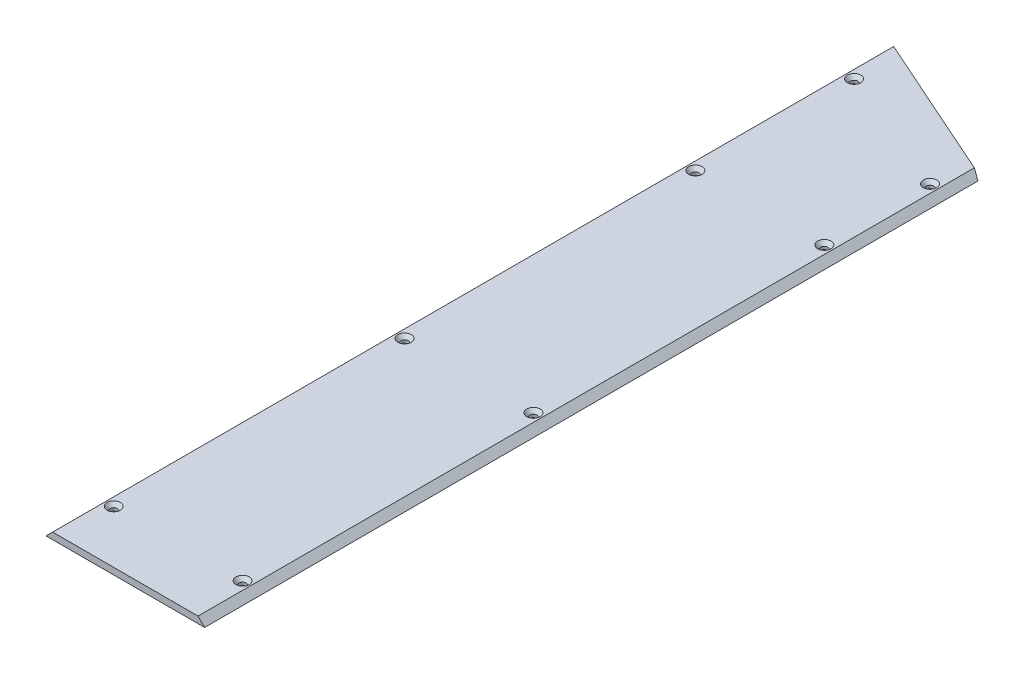
ISO-10303-21;
HEADER;
FILE_DESCRIPTION(('STEP AP214'),'2;1');
FILE_NAME('part.step','',(''),(''),'','','');
FILE_SCHEMA(('AUTOMOTIVE_DESIGN { 1 0 10303 214 1 1 1 1 }'));
ENDSEC;
DATA;
#1=APPLICATION_CONTEXT('core data for automotive mechanical design processes');
#2=APPLICATION_PROTOCOL_DEFINITION('international standard','automotive_design',2000,#1);
#3=PRODUCT_CONTEXT('',#1,'mechanical');
#4=PRODUCT('Part','Part','',(#3));
#5=PRODUCT_RELATED_PRODUCT_CATEGORY('part','',(#4));
#6=PRODUCT_DEFINITION_FORMATION('','',#4);
#7=PRODUCT_DEFINITION_CONTEXT('part definition',#1,'design');
#8=PRODUCT_DEFINITION('design','',#6,#7);
#9=PRODUCT_DEFINITION_SHAPE('','',#8);
#10=(LENGTH_UNIT() NAMED_UNIT(*) SI_UNIT(.MILLI.,.METRE.));
#11=(NAMED_UNIT(*) PLANE_ANGLE_UNIT() SI_UNIT($,.RADIAN.));
#12=(NAMED_UNIT(*) SI_UNIT($,.STERADIAN.) SOLID_ANGLE_UNIT());
#13=UNCERTAINTY_MEASURE_WITH_UNIT(LENGTH_MEASURE(1.E-05),#10,'distance_accuracy_value','');
#14=(GEOMETRIC_REPRESENTATION_CONTEXT(3) GLOBAL_UNCERTAINTY_ASSIGNED_CONTEXT((#13)) GLOBAL_UNIT_ASSIGNED_CONTEXT((#10,
#11,#12)) REPRESENTATION_CONTEXT('',''));
#15=CARTESIAN_POINT('',(0.,0.,0.));
#16=DIRECTION('',(0.,0.,1.));
#17=DIRECTION('',(1.,0.,0.));
#18=AXIS2_PLACEMENT_3D('',#15,#16,#17);
#19=CARTESIAN_POINT('',(0.,6.35,0.));
#20=DIRECTION('',(0.,0.,-1.));
#21=DIRECTION('',(-1.,0.,0.));
#22=AXIS2_PLACEMENT_3D('',#19,#20,#21);
#23=PLANE('',#22);
#24=DIRECTION('',(1.,0.,0.));
#25=VECTOR('',#24,1.);
#26=CARTESIAN_POINT('',(0.,0.,0.));
#27=LINE('',#26,#25);
#28=CARTESIAN_POINT('',(0.,0.,0.));
#29=VERTEX_POINT('',#28);
#30=CARTESIAN_POINT('',(152.4,0.,0.));
#31=VERTEX_POINT('',#30);
#32=EDGE_CURVE('E91',#29,#31,#27,.T.);
#33=ORIENTED_EDGE('',*,*,#32,.T.);
#34=DIRECTION('',(0.707106781186548,-0.707106781186548,0.));
#35=VECTOR('',#34,1.);
#36=CARTESIAN_POINT('',(146.05,6.35,0.));
#37=LINE('',#36,#35);
#38=CARTESIAN_POINT('',(146.05,6.35,0.));
#39=VERTEX_POINT('',#38);
#40=EDGE_CURVE('E40',#31,#39,#37,.F.);
#41=ORIENTED_EDGE('',*,*,#40,.T.);
#42=DIRECTION('',(1.,0.,0.));
#43=VECTOR('',#42,1.);
#44=CARTESIAN_POINT('',(0.,6.35,0.));
#45=LINE('',#44,#43);
#46=CARTESIAN_POINT('',(6.34999999999985,6.35,0.));
#47=VERTEX_POINT('',#46);
#48=EDGE_CURVE('E90',#47,#39,#45,.T.);
#49=ORIENTED_EDGE('',*,*,#48,.F.);
#50=DIRECTION('',(0.707106781186541,0.707106781186554,0.));
#51=VECTOR('',#50,1.);
#52=CARTESIAN_POINT('',(6.34999999999986,6.35,0.));
#53=LINE('',#52,#51);
#54=EDGE_CURVE('E101',#47,#29,#53,.F.);
#55=ORIENTED_EDGE('',*,*,#54,.T.);
#56=EDGE_LOOP('',(#33,#41,#49,#55));
#57=FACE_BOUND('',#56,.T.);
#58=ADVANCED_FACE('F32',(#57),#23,.F.);
#59=CARTESIAN_POINT('',(0.,6.35,0.));
#60=DIRECTION('',(0.,-1.,0.));
#61=DIRECTION('',(0.,0.,-1.));
#62=AXIS2_PLACEMENT_3D('',#59,#60,#61);
#63=PLANE('',#62);
#64=CARTESIAN_POINT('',(14.2875,6.35,-762.));
#65=DIRECTION('',(0.,1.,0.));
#66=DIRECTION('',(0.,0.,1.));
#67=AXIS2_PLACEMENT_3D('',#64,#65,#66);
#68=CIRCLE('',#67,6.4389);
#69=CARTESIAN_POINT('',(14.2875,6.35,-755.5611));
#70=VERTEX_POINT('',#69);
#71=EDGE_CURVE('E176',#70,#70,#68,.T.);
#72=ORIENTED_EDGE('',*,*,#71,.F.);
#73=EDGE_LOOP('',(#72));
#74=FACE_BOUND('',#73,.T.);
#75=CARTESIAN_POINT('',(138.1125,6.35,-711.2));
#76=DIRECTION('',(0.,1.,0.));
#77=DIRECTION('',(0.,0.,1.));
#78=AXIS2_PLACEMENT_3D('',#75,#76,#77);
#79=CIRCLE('',#78,6.4389);
#80=CARTESIAN_POINT('',(138.1125,6.35,-704.7611));
#81=VERTEX_POINT('',#80);
#82=EDGE_CURVE('E167',#81,#81,#79,.T.);
#83=ORIENTED_EDGE('',*,*,#82,.F.);
#84=EDGE_LOOP('',(#83));
#85=FACE_BOUND('',#84,.T.);
#86=CARTESIAN_POINT('',(138.1125,6.35,-609.6));
#87=DIRECTION('',(0.,1.,0.));
#88=DIRECTION('',(0.,0.,1.));
#89=AXIS2_PLACEMENT_3D('',#86,#87,#88);
#90=CIRCLE('',#89,6.4389);
#91=CARTESIAN_POINT('',(138.1125,6.35,-603.1611));
#92=VERTEX_POINT('',#91);
#93=EDGE_CURVE('E78',#92,#92,#90,.T.);
#94=ORIENTED_EDGE('',*,*,#93,.F.);
#95=EDGE_LOOP('',(#94));
#96=FACE_BOUND('',#95,.T.);
#97=CARTESIAN_POINT('',(138.112500000003,6.35,-330.2));
#98=DIRECTION('',(0.,1.,0.));
#99=DIRECTION('',(0.,0.,1.));
#100=AXIS2_PLACEMENT_3D('',#97,#98,#99);
#101=CIRCLE('',#100,6.4389);
#102=CARTESIAN_POINT('',(138.112500000003,6.35,-323.7611));
#103=VERTEX_POINT('',#102);
#104=EDGE_CURVE('E149',#103,#103,#101,.T.);
#105=ORIENTED_EDGE('',*,*,#104,.F.);
#106=EDGE_LOOP('',(#105));
#107=FACE_BOUND('',#106,.T.);
#108=CARTESIAN_POINT('',(138.112500000006,6.35,-50.8000000000002));
#109=DIRECTION('',(0.,1.,0.));
#110=DIRECTION('',(0.,0.,1.));
#111=AXIS2_PLACEMENT_3D('',#108,#109,#110);
#112=CIRCLE('',#111,6.4389);
#113=CARTESIAN_POINT('',(138.112500000006,6.35,-44.3611000000002));
#114=VERTEX_POINT('',#113);
#115=EDGE_CURVE('E140',#114,#114,#112,.T.);
#116=ORIENTED_EDGE('',*,*,#115,.F.);
#117=EDGE_LOOP('',(#116));
#118=FACE_BOUND('',#117,.T.);
#119=CARTESIAN_POINT('',(14.2875,6.35,-609.6));
#120=DIRECTION('',(0.,1.,0.));
#121=DIRECTION('',(0.,0.,1.));
#122=AXIS2_PLACEMENT_3D('',#119,#120,#121);
#123=CIRCLE('',#122,6.4389);
#124=CARTESIAN_POINT('',(14.2875,6.35,-603.1611));
#125=VERTEX_POINT('',#124);
#126=EDGE_CURVE('E131',#125,#125,#123,.T.);
#127=ORIENTED_EDGE('',*,*,#126,.F.);
#128=EDGE_LOOP('',(#127));
#129=FACE_BOUND('',#128,.T.);
#130=CARTESIAN_POINT('',(14.2875000000029,6.35,-330.2));
#131=DIRECTION('',(0.,1.,0.));
#132=DIRECTION('',(0.,0.,1.));
#133=AXIS2_PLACEMENT_3D('',#130,#131,#132);
#134=CIRCLE('',#133,6.4389);
#135=CARTESIAN_POINT('',(14.2875000000029,6.35,-323.7611));
#136=VERTEX_POINT('',#135);
#137=EDGE_CURVE('E122',#136,#136,#134,.T.);
#138=ORIENTED_EDGE('',*,*,#137,.F.);
#139=EDGE_LOOP('',(#138));
#140=FACE_BOUND('',#139,.T.);
#141=CARTESIAN_POINT('',(14.2875000000059,6.35,-50.8000000000002));
#142=DIRECTION('',(0.,1.,0.));
#143=DIRECTION('',(0.,0.,1.));
#144=AXIS2_PLACEMENT_3D('',#141,#142,#143);
#145=CIRCLE('',#144,6.4389);
#146=CARTESIAN_POINT('',(14.2875000000059,6.35,-44.3611000000002));
#147=VERTEX_POINT('',#146);
#148=EDGE_CURVE('E113',#147,#147,#145,.T.);
#149=ORIENTED_EDGE('',*,*,#148,.F.);
#150=EDGE_LOOP('',(#149));
#151=FACE_BOUND('',#150,.T.);
#152=DIRECTION('',(0.,0.,-1.));
#153=VECTOR('',#152,1.);
#154=CARTESIAN_POINT('',(146.05,6.35,0.));
#155=LINE('',#154,#153);
#156=CARTESIAN_POINT('',(146.05,6.35,-745.777202151709));
#157=VERTEX_POINT('',#156);
#158=EDGE_CURVE('E99',#39,#157,#155,.T.);
#159=ORIENTED_EDGE('',*,*,#158,.T.);
#160=DIRECTION('',(0.913545457642602,0.,0.406736643075797));
#161=VECTOR('',#160,1.);
#162=CARTESIAN_POINT('',(152.4,6.35,-742.95));
#163=LINE('',#162,#161);
#164=CARTESIAN_POINT('',(6.34999999999986,6.35,-807.975649489311));
#165=VERTEX_POINT('',#164);
#166=EDGE_CURVE('E73',#165,#157,#163,.T.);
#167=ORIENTED_EDGE('',*,*,#166,.F.);
#168=DIRECTION('',(0.,0.,1.));
#169=VECTOR('',#168,1.);
#170=CARTESIAN_POINT('',(6.34999999999986,6.35,0.));
#171=LINE('',#170,#169);
#172=EDGE_CURVE('E93',#165,#47,#171,.T.);
#173=ORIENTED_EDGE('',*,*,#172,.T.);
#174=ORIENTED_EDGE('',*,*,#48,.T.);
#175=EDGE_LOOP('',(#159,#167,#173,#174));
#176=FACE_BOUND('',#175,.T.);
#177=ADVANCED_FACE('F182',(#74,#85,#96,#107,#118,#129,#140,#151,#176),#63,.F.);
#178=CARTESIAN_POINT('',(0.,0.,0.));
#179=DIRECTION('',(0.,-1.,0.));
#180=DIRECTION('',(0.,0.,-1.));
#181=AXIS2_PLACEMENT_3D('',#178,#179,#180);
#182=PLANE('',#181);
#183=CARTESIAN_POINT('',(14.2875,0.,-762.));
#184=DIRECTION('',(0.,1.,0.));
#185=DIRECTION('',(0.,0.,1.));
#186=AXIS2_PLACEMENT_3D('',#183,#184,#185);
#187=CIRCLE('',#186,3.3782);
#188=CARTESIAN_POINT('',(14.2875,0.,-758.6218));
#189=VERTEX_POINT('',#188);
#190=EDGE_CURVE('E170',#189,#189,#187,.T.);
#191=ORIENTED_EDGE('',*,*,#190,.T.);
#192=EDGE_LOOP('',(#191));
#193=FACE_BOUND('',#192,.T.);
#194=CARTESIAN_POINT('',(138.1125,0.,-711.2));
#195=DIRECTION('',(0.,1.,0.));
#196=DIRECTION('',(0.,0.,1.));
#197=AXIS2_PLACEMENT_3D('',#194,#195,#196);
#198=CIRCLE('',#197,3.3782);
#199=CARTESIAN_POINT('',(138.1125,0.,-707.8218));
#200=VERTEX_POINT('',#199);
#201=EDGE_CURVE('E160',#200,#200,#198,.T.);
#202=ORIENTED_EDGE('',*,*,#201,.T.);
#203=EDGE_LOOP('',(#202));
#204=FACE_BOUND('',#203,.T.);
#205=DIRECTION('',(0.913545457642602,0.,0.406736643075797));
#206=VECTOR('',#205,1.);
#207=CARTESIAN_POINT('',(152.4,0.,-742.95));
#208=LINE('',#207,#206);
#209=CARTESIAN_POINT('',(0.,0.,-810.80285164102));
#210=VERTEX_POINT('',#209);
#211=CARTESIAN_POINT('',(152.4,0.,-742.95));
#212=VERTEX_POINT('',#211);
#213=EDGE_CURVE('E46',#210,#212,#208,.T.);
#214=ORIENTED_EDGE('',*,*,#213,.T.);
#215=DIRECTION('',(0.,0.,-1.));
#216=VECTOR('',#215,1.);
#217=CARTESIAN_POINT('',(152.4,0.,0.));
#218=LINE('',#217,#216);
#219=EDGE_CURVE('E86',#31,#212,#218,.T.);
#220=ORIENTED_EDGE('',*,*,#219,.F.);
#221=ORIENTED_EDGE('',*,*,#32,.F.);
#222=DIRECTION('',(0.,0.,1.));
#223=VECTOR('',#222,1.);
#224=CARTESIAN_POINT('',(0.,0.,0.));
#225=LINE('',#224,#223);
#226=EDGE_CURVE('E87',#210,#29,#225,.T.);
#227=ORIENTED_EDGE('',*,*,#226,.F.);
#228=EDGE_LOOP('',(#214,#220,#221,#227));
#229=FACE_BOUND('',#228,.T.);
#230=CARTESIAN_POINT('',(138.1125,0.,-609.6));
#231=DIRECTION('',(0.,1.,0.));
#232=DIRECTION('',(0.,0.,1.));
#233=AXIS2_PLACEMENT_3D('',#230,#231,#232);
#234=CIRCLE('',#233,3.3782);
#235=CARTESIAN_POINT('',(138.1125,0.,-606.2218));
#236=VERTEX_POINT('',#235);
#237=EDGE_CURVE('E152',#236,#236,#234,.T.);
#238=ORIENTED_EDGE('',*,*,#237,.T.);
#239=EDGE_LOOP('',(#238));
#240=FACE_BOUND('',#239,.T.);
#241=CARTESIAN_POINT('',(138.112500000003,0.,-330.2));
#242=DIRECTION('',(0.,1.,0.));
#243=DIRECTION('',(0.,0.,1.));
#244=AXIS2_PLACEMENT_3D('',#241,#242,#243);
#245=CIRCLE('',#244,3.3782);
#246=CARTESIAN_POINT('',(138.112500000003,0.,-326.8218));
#247=VERTEX_POINT('',#246);
#248=EDGE_CURVE('E143',#247,#247,#245,.T.);
#249=ORIENTED_EDGE('',*,*,#248,.T.);
#250=EDGE_LOOP('',(#249));
#251=FACE_BOUND('',#250,.T.);
#252=CARTESIAN_POINT('',(138.112500000006,0.,-50.8000000000002));
#253=DIRECTION('',(0.,1.,0.));
#254=DIRECTION('',(0.,0.,1.));
#255=AXIS2_PLACEMENT_3D('',#252,#253,#254);
#256=CIRCLE('',#255,3.3782);
#257=CARTESIAN_POINT('',(138.112500000006,0.,-47.4218000000002));
#258=VERTEX_POINT('',#257);
#259=EDGE_CURVE('E134',#258,#258,#256,.T.);
#260=ORIENTED_EDGE('',*,*,#259,.T.);
#261=EDGE_LOOP('',(#260));
#262=FACE_BOUND('',#261,.T.);
#263=CARTESIAN_POINT('',(14.2875,0.,-609.6));
#264=DIRECTION('',(0.,1.,0.));
#265=DIRECTION('',(0.,0.,1.));
#266=AXIS2_PLACEMENT_3D('',#263,#264,#265);
#267=CIRCLE('',#266,3.37819999999999);
#268=CARTESIAN_POINT('',(14.2875,0.,-606.2218));
#269=VERTEX_POINT('',#268);
#270=EDGE_CURVE('E125',#269,#269,#267,.T.);
#271=ORIENTED_EDGE('',*,*,#270,.T.);
#272=EDGE_LOOP('',(#271));
#273=FACE_BOUND('',#272,.T.);
#274=CARTESIAN_POINT('',(14.2875000000029,0.,-330.2));
#275=DIRECTION('',(0.,1.,0.));
#276=DIRECTION('',(0.,0.,1.));
#277=AXIS2_PLACEMENT_3D('',#274,#275,#276);
#278=CIRCLE('',#277,3.37819999999999);
#279=CARTESIAN_POINT('',(14.2875000000029,0.,-326.8218));
#280=VERTEX_POINT('',#279);
#281=EDGE_CURVE('E116',#280,#280,#278,.T.);
#282=ORIENTED_EDGE('',*,*,#281,.T.);
#283=EDGE_LOOP('',(#282));
#284=FACE_BOUND('',#283,.T.);
#285=CARTESIAN_POINT('',(14.2875000000059,0.,-50.8000000000002));
#286=DIRECTION('',(0.,1.,0.));
#287=DIRECTION('',(0.,0.,1.));
#288=AXIS2_PLACEMENT_3D('',#285,#286,#287);
#289=CIRCLE('',#288,3.37819999999999);
#290=CARTESIAN_POINT('',(14.2875000000059,0.,-47.4218000000002));
#291=VERTEX_POINT('',#290);
#292=EDGE_CURVE('E106',#291,#291,#289,.T.);
#293=ORIENTED_EDGE('',*,*,#292,.T.);
#294=EDGE_LOOP('',(#293));
#295=FACE_BOUND('',#294,.T.);
#296=ADVANCED_FACE('F83',(#193,#204,#229,#240,#251,#262,#273,#284,#295),#182,.T.);
#297=CARTESIAN_POINT('',(14.2875000000059,6.35,-50.8000000000002));
#298=DIRECTION('',(0.,1.,0.));
#299=DIRECTION('',(0.,0.,1.));
#300=AXIS2_PLACEMENT_3D('',#297,#298,#299);
#301=CYLINDRICAL_SURFACE('',#300,3.37819999999999);
#302=ORIENTED_EDGE('',*,*,#292,.F.);
#303=EDGE_LOOP('',(#302));
#304=FACE_BOUND('',#303,.T.);
#305=CARTESIAN_POINT('',(14.2875000000059,2.82906741601866,-50.8000000000002));
#306=DIRECTION('',(0.,1.,0.));
#307=DIRECTION('',(0.,0.,1.));
#308=AXIS2_PLACEMENT_3D('',#305,#306,#307);
#309=CIRCLE('',#308,3.3782);
#310=CARTESIAN_POINT('',(14.2875000000059,2.82906741601866,-47.4218000000002));
#311=VERTEX_POINT('',#310);
#312=EDGE_CURVE('E108',#311,#311,#309,.T.);
#313=ORIENTED_EDGE('',*,*,#312,.T.);
#314=EDGE_LOOP('',(#313));
#315=FACE_BOUND('',#314,.T.);
#316=ADVANCED_FACE('F204',(#304,#315),#301,.F.);
#317=CARTESIAN_POINT('',(14.2875000000059,6.35,-50.8000000000002));
#318=DIRECTION('',(0.,1.,0.));
#319=DIRECTION('',(0.,0.,1.));
#320=AXIS2_PLACEMENT_3D('',#317,#318,#319);
#321=CONICAL_SURFACE('',#320,6.4389,0.715584993317675);
#322=ORIENTED_EDGE('',*,*,#312,.F.);
#323=EDGE_LOOP('',(#322));
#324=FACE_BOUND('',#323,.T.);
#325=ORIENTED_EDGE('',*,*,#148,.T.);
#326=EDGE_LOOP('',(#325));
#327=FACE_BOUND('',#326,.T.);
#328=ADVANCED_FACE('F201',(#324,#327),#321,.F.);
#329=CARTESIAN_POINT('',(14.2875000000029,6.35,-330.2));
#330=DIRECTION('',(0.,1.,0.));
#331=DIRECTION('',(0.,0.,1.));
#332=AXIS2_PLACEMENT_3D('',#329,#330,#331);
#333=CYLINDRICAL_SURFACE('',#332,3.37819999999999);
#334=ORIENTED_EDGE('',*,*,#281,.F.);
#335=EDGE_LOOP('',(#334));
#336=FACE_BOUND('',#335,.T.);
#337=CARTESIAN_POINT('',(14.2875000000029,2.82906741601866,-330.2));
#338=DIRECTION('',(0.,1.,0.));
#339=DIRECTION('',(0.,0.,1.));
#340=AXIS2_PLACEMENT_3D('',#337,#338,#339);
#341=CIRCLE('',#340,3.3782);
#342=CARTESIAN_POINT('',(14.2875000000029,2.82906741601866,-326.8218));
#343=VERTEX_POINT('',#342);
#344=EDGE_CURVE('E119',#343,#343,#341,.T.);
#345=ORIENTED_EDGE('',*,*,#344,.T.);
#346=EDGE_LOOP('',(#345));
#347=FACE_BOUND('',#346,.T.);
#348=ADVANCED_FACE('F203',(#336,#347),#333,.F.);
#349=CARTESIAN_POINT('',(14.2875000000029,6.35,-330.2));
#350=DIRECTION('',(0.,1.,0.));
#351=DIRECTION('',(0.,0.,1.));
#352=AXIS2_PLACEMENT_3D('',#349,#350,#351);
#353=CONICAL_SURFACE('',#352,6.4389,0.715584993317675);
#354=ORIENTED_EDGE('',*,*,#344,.F.);
#355=EDGE_LOOP('',(#354));
#356=FACE_BOUND('',#355,.T.);
#357=ORIENTED_EDGE('',*,*,#137,.T.);
#358=EDGE_LOOP('',(#357));
#359=FACE_BOUND('',#358,.T.);
#360=ADVANCED_FACE('F211',(#356,#359),#353,.F.);
#361=CARTESIAN_POINT('',(14.2875,6.35,-609.6));
#362=DIRECTION('',(0.,1.,0.));
#363=DIRECTION('',(0.,0.,1.));
#364=AXIS2_PLACEMENT_3D('',#361,#362,#363);
#365=CYLINDRICAL_SURFACE('',#364,3.37819999999999);
#366=ORIENTED_EDGE('',*,*,#270,.F.);
#367=EDGE_LOOP('',(#366));
#368=FACE_BOUND('',#367,.T.);
#369=CARTESIAN_POINT('',(14.2875,2.82906741601866,-609.6));
#370=DIRECTION('',(0.,1.,0.));
#371=DIRECTION('',(0.,0.,1.));
#372=AXIS2_PLACEMENT_3D('',#369,#370,#371);
#373=CIRCLE('',#372,3.3782);
#374=CARTESIAN_POINT('',(14.2875,2.82906741601866,-606.2218));
#375=VERTEX_POINT('',#374);
#376=EDGE_CURVE('E128',#375,#375,#373,.T.);
#377=ORIENTED_EDGE('',*,*,#376,.T.);
#378=EDGE_LOOP('',(#377));
#379=FACE_BOUND('',#378,.T.);
#380=ADVANCED_FACE('F260',(#368,#379),#365,.F.);
#381=CARTESIAN_POINT('',(14.2875,6.35,-609.6));
#382=DIRECTION('',(0.,1.,0.));
#383=DIRECTION('',(0.,0.,1.));
#384=AXIS2_PLACEMENT_3D('',#381,#382,#383);
#385=CONICAL_SURFACE('',#384,6.4389,0.715584993317675);
#386=ORIENTED_EDGE('',*,*,#376,.F.);
#387=EDGE_LOOP('',(#386));
#388=FACE_BOUND('',#387,.T.);
#389=ORIENTED_EDGE('',*,*,#126,.T.);
#390=EDGE_LOOP('',(#389));
#391=FACE_BOUND('',#390,.T.);
#392=ADVANCED_FACE('F256',(#388,#391),#385,.F.);
#393=CARTESIAN_POINT('',(138.112500000006,6.35,-50.8000000000002));
#394=DIRECTION('',(0.,1.,0.));
#395=DIRECTION('',(0.,0.,1.));
#396=AXIS2_PLACEMENT_3D('',#393,#394,#395);
#397=CYLINDRICAL_SURFACE('',#396,3.3782);
#398=ORIENTED_EDGE('',*,*,#259,.F.);
#399=EDGE_LOOP('',(#398));
#400=FACE_BOUND('',#399,.T.);
#401=CARTESIAN_POINT('',(138.112500000006,2.82906741601866,-50.8000000000002));
#402=DIRECTION('',(0.,1.,0.));
#403=DIRECTION('',(0.,0.,1.));
#404=AXIS2_PLACEMENT_3D('',#401,#402,#403);
#405=CIRCLE('',#404,3.3782);
#406=CARTESIAN_POINT('',(138.112500000006,2.82906741601866,-47.4218000000002));
#407=VERTEX_POINT('',#406);
#408=EDGE_CURVE('E137',#407,#407,#405,.T.);
#409=ORIENTED_EDGE('',*,*,#408,.T.);
#410=EDGE_LOOP('',(#409));
#411=FACE_BOUND('',#410,.T.);
#412=ADVANCED_FACE('F252',(#400,#411),#397,.F.);
#413=CARTESIAN_POINT('',(138.112500000006,6.35,-50.8000000000002));
#414=DIRECTION('',(0.,1.,0.));
#415=DIRECTION('',(0.,0.,1.));
#416=AXIS2_PLACEMENT_3D('',#413,#414,#415);
#417=CONICAL_SURFACE('',#416,6.4389,0.715584993317675);
#418=ORIENTED_EDGE('',*,*,#408,.F.);
#419=EDGE_LOOP('',(#418));
#420=FACE_BOUND('',#419,.T.);
#421=ORIENTED_EDGE('',*,*,#115,.T.);
#422=EDGE_LOOP('',(#421));
#423=FACE_BOUND('',#422,.T.);
#424=ADVANCED_FACE('F248',(#420,#423),#417,.F.);
#425=CARTESIAN_POINT('',(138.112500000003,6.35,-330.2));
#426=DIRECTION('',(0.,1.,0.));
#427=DIRECTION('',(0.,0.,1.));
#428=AXIS2_PLACEMENT_3D('',#425,#426,#427);
#429=CYLINDRICAL_SURFACE('',#428,3.3782);
#430=ORIENTED_EDGE('',*,*,#248,.F.);
#431=EDGE_LOOP('',(#430));
#432=FACE_BOUND('',#431,.T.);
#433=CARTESIAN_POINT('',(138.112500000003,2.82906741601866,-330.2));
#434=DIRECTION('',(0.,1.,0.));
#435=DIRECTION('',(0.,0.,1.));
#436=AXIS2_PLACEMENT_3D('',#433,#434,#435);
#437=CIRCLE('',#436,3.3782);
#438=CARTESIAN_POINT('',(138.112500000003,2.82906741601866,-326.8218));
#439=VERTEX_POINT('',#438);
#440=EDGE_CURVE('E146',#439,#439,#437,.T.);
#441=ORIENTED_EDGE('',*,*,#440,.T.);
#442=EDGE_LOOP('',(#441));
#443=FACE_BOUND('',#442,.T.);
#444=ADVANCED_FACE('F244',(#432,#443),#429,.F.);
#445=CARTESIAN_POINT('',(138.112500000003,6.35,-330.2));
#446=DIRECTION('',(0.,1.,0.));
#447=DIRECTION('',(0.,0.,1.));
#448=AXIS2_PLACEMENT_3D('',#445,#446,#447);
#449=CONICAL_SURFACE('',#448,6.4389,0.715584993317675);
#450=ORIENTED_EDGE('',*,*,#440,.F.);
#451=EDGE_LOOP('',(#450));
#452=FACE_BOUND('',#451,.T.);
#453=ORIENTED_EDGE('',*,*,#104,.T.);
#454=EDGE_LOOP('',(#453));
#455=FACE_BOUND('',#454,.T.);
#456=ADVANCED_FACE('F234',(#452,#455),#449,.F.);
#457=CARTESIAN_POINT('',(138.1125,6.35,-609.6));
#458=DIRECTION('',(0.,1.,0.));
#459=DIRECTION('',(0.,0.,1.));
#460=AXIS2_PLACEMENT_3D('',#457,#458,#459);
#461=CYLINDRICAL_SURFACE('',#460,3.3782);
#462=ORIENTED_EDGE('',*,*,#237,.F.);
#463=EDGE_LOOP('',(#462));
#464=FACE_BOUND('',#463,.T.);
#465=CARTESIAN_POINT('',(138.1125,2.82906741601866,-609.6));
#466=DIRECTION('',(0.,1.,0.));
#467=DIRECTION('',(0.,0.,1.));
#468=AXIS2_PLACEMENT_3D('',#465,#466,#467);
#469=CIRCLE('',#468,3.3782);
#470=CARTESIAN_POINT('',(138.1125,2.82906741601866,-606.2218));
#471=VERTEX_POINT('',#470);
#472=EDGE_CURVE('E155',#471,#471,#469,.T.);
#473=ORIENTED_EDGE('',*,*,#472,.T.);
#474=EDGE_LOOP('',(#473));
#475=FACE_BOUND('',#474,.T.);
#476=ADVANCED_FACE('F228',(#464,#475),#461,.F.);
#477=CARTESIAN_POINT('',(138.1125,6.35,-609.6));
#478=DIRECTION('',(0.,1.,0.));
#479=DIRECTION('',(0.,0.,1.));
#480=AXIS2_PLACEMENT_3D('',#477,#478,#479);
#481=CONICAL_SURFACE('',#480,6.4389,0.715584993317675);
#482=ORIENTED_EDGE('',*,*,#472,.F.);
#483=EDGE_LOOP('',(#482));
#484=FACE_BOUND('',#483,.T.);
#485=ORIENTED_EDGE('',*,*,#93,.T.);
#486=EDGE_LOOP('',(#485));
#487=FACE_BOUND('',#486,.T.);
#488=ADVANCED_FACE('F223',(#484,#487),#481,.F.);
#489=CARTESIAN_POINT('',(146.05,6.35,0.));
#490=DIRECTION('',(-0.707106781186548,-0.707106781186548,0.));
#491=DIRECTION('',(0.,0.,-1.));
#492=AXIS2_PLACEMENT_3D('',#489,#490,#491);
#493=PLANE('',#492);
#494=DIRECTION('',(-0.674471455947178,0.674471455947178,-0.300294039609494));
#495=VECTOR('',#494,1.);
#496=CARTESIAN_POINT('',(297.099534126026,-144.699534126026,-678.525616656313));
#497=LINE('',#496,#495);
#498=EDGE_CURVE('E70',#157,#212,#497,.F.);
#499=ORIENTED_EDGE('',*,*,#498,.F.);
#500=ORIENTED_EDGE('',*,*,#158,.F.);
#501=ORIENTED_EDGE('',*,*,#40,.F.);
#502=ORIENTED_EDGE('',*,*,#219,.T.);
#503=EDGE_LOOP('',(#499,#500,#501,#502));
#504=FACE_BOUND('',#503,.T.);
#505=ADVANCED_FACE('F89',(#504),#493,.F.);
#506=CARTESIAN_POINT('',(6.34999999999986,6.35,0.));
#507=DIRECTION('',(0.707106781186554,-0.707106781186541,0.));
#508=DIRECTION('',(0.,0.,1.));
#509=AXIS2_PLACEMENT_3D('',#506,#507,#508);
#510=PLANE('',#509);
#511=DIRECTION('',(-0.674471455947173,-0.674471455947184,-0.300294039609491));
#512=VECTOR('',#511,1.);
#513=CARTESIAN_POINT('',(169.997192604454,169.997192604457,-735.115225071598));
#514=LINE('',#513,#512);
#515=EDGE_CURVE('E11',#210,#165,#514,.F.);
#516=ORIENTED_EDGE('',*,*,#515,.F.);
#517=ORIENTED_EDGE('',*,*,#226,.T.);
#518=ORIENTED_EDGE('',*,*,#54,.F.);
#519=ORIENTED_EDGE('',*,*,#172,.F.);
#520=EDGE_LOOP('',(#516,#517,#518,#519));
#521=FACE_BOUND('',#520,.T.);
#522=ADVANCED_FACE('F34',(#521),#510,.F.);
#523=CARTESIAN_POINT('',(152.4,0.,-742.95));
#524=DIRECTION('',(-0.406736643075797,0.,0.913545457642602));
#525=DIRECTION('',(0.913545457642602,0.,0.406736643075797));
#526=AXIS2_PLACEMENT_3D('',#523,#524,#525);
#527=PLANE('',#526);
#528=ORIENTED_EDGE('',*,*,#498,.T.);
#529=ORIENTED_EDGE('',*,*,#213,.F.);
#530=ORIENTED_EDGE('',*,*,#515,.T.);
#531=ORIENTED_EDGE('',*,*,#166,.T.);
#532=EDGE_LOOP('',(#528,#529,#530,#531));
#533=FACE_BOUND('',#532,.T.);
#534=ADVANCED_FACE('F71',(#533),#527,.F.);
#535=CARTESIAN_POINT('',(138.1125,6.35,-711.2));
#536=DIRECTION('',(0.,1.,0.));
#537=DIRECTION('',(0.,0.,1.));
#538=AXIS2_PLACEMENT_3D('',#535,#536,#537);
#539=CYLINDRICAL_SURFACE('',#538,3.3782);
#540=ORIENTED_EDGE('',*,*,#201,.F.);
#541=EDGE_LOOP('',(#540));
#542=FACE_BOUND('',#541,.T.);
#543=CARTESIAN_POINT('',(138.1125,2.82906741601865,-711.2));
#544=DIRECTION('',(0.,1.,0.));
#545=DIRECTION('',(0.,0.,1.));
#546=AXIS2_PLACEMENT_3D('',#543,#544,#545);
#547=CIRCLE('',#546,3.3782);
#548=CARTESIAN_POINT('',(138.1125,2.82906741601865,-707.8218));
#549=VERTEX_POINT('',#548);
#550=EDGE_CURVE('E164',#549,#549,#547,.T.);
#551=ORIENTED_EDGE('',*,*,#550,.T.);
#552=EDGE_LOOP('',(#551));
#553=FACE_BOUND('',#552,.T.);
#554=ADVANCED_FACE('F330',(#542,#553),#539,.F.);
#555=CARTESIAN_POINT('',(138.1125,6.35,-711.2));
#556=DIRECTION('',(0.,1.,0.));
#557=DIRECTION('',(0.,0.,1.));
#558=AXIS2_PLACEMENT_3D('',#555,#556,#557);
#559=CONICAL_SURFACE('',#558,6.4389,0.715584993317675);
#560=ORIENTED_EDGE('',*,*,#550,.F.);
#561=EDGE_LOOP('',(#560));
#562=FACE_BOUND('',#561,.T.);
#563=ORIENTED_EDGE('',*,*,#82,.T.);
#564=EDGE_LOOP('',(#563));
#565=FACE_BOUND('',#564,.T.);
#566=ADVANCED_FACE('F352',(#562,#565),#559,.F.);
#567=CARTESIAN_POINT('',(14.2875,6.35,-762.));
#568=DIRECTION('',(0.,1.,0.));
#569=DIRECTION('',(0.,0.,1.));
#570=AXIS2_PLACEMENT_3D('',#567,#568,#569);
#571=CYLINDRICAL_SURFACE('',#570,3.3782);
#572=ORIENTED_EDGE('',*,*,#190,.F.);
#573=EDGE_LOOP('',(#572));
#574=FACE_BOUND('',#573,.T.);
#575=CARTESIAN_POINT('',(14.2875,2.82906741601865,-762.));
#576=DIRECTION('',(0.,1.,0.));
#577=DIRECTION('',(0.,0.,1.));
#578=AXIS2_PLACEMENT_3D('',#575,#576,#577);
#579=CIRCLE('',#578,3.3782);
#580=CARTESIAN_POINT('',(14.2875,2.82906741601865,-758.6218));
#581=VERTEX_POINT('',#580);
#582=EDGE_CURVE('E173',#581,#581,#579,.T.);
#583=ORIENTED_EDGE('',*,*,#582,.T.);
#584=EDGE_LOOP('',(#583));
#585=FACE_BOUND('',#584,.T.);
#586=ADVANCED_FACE('F361',(#574,#585),#571,.F.);
#587=CARTESIAN_POINT('',(14.2875,6.35,-762.));
#588=DIRECTION('',(0.,1.,0.));
#589=DIRECTION('',(0.,0.,1.));
#590=AXIS2_PLACEMENT_3D('',#587,#588,#589);
#591=CONICAL_SURFACE('',#590,6.4389,0.715584993317675);
#592=ORIENTED_EDGE('',*,*,#582,.F.);
#593=EDGE_LOOP('',(#592));
#594=FACE_BOUND('',#593,.T.);
#595=ORIENTED_EDGE('',*,*,#71,.T.);
#596=EDGE_LOOP('',(#595));
#597=FACE_BOUND('',#596,.T.);
#598=ADVANCED_FACE('F180',(#594,#597),#591,.F.);
#599=CLOSED_SHELL('',(#58,#177,#296,#316,#328,#348,#360,#380,#392,#412,#424,#444,#456,#476,#488,
#505,#522,#534,#554,#566,#586,#598));
#600=MANIFOLD_SOLID_BREP('B2',#599);
#601=ADVANCED_BREP_SHAPE_REPRESENTATION('',(#18,#600),#14);
#602=SHAPE_DEFINITION_REPRESENTATION(#9,#601);
ENDSEC;
END-ISO-10303-21;
